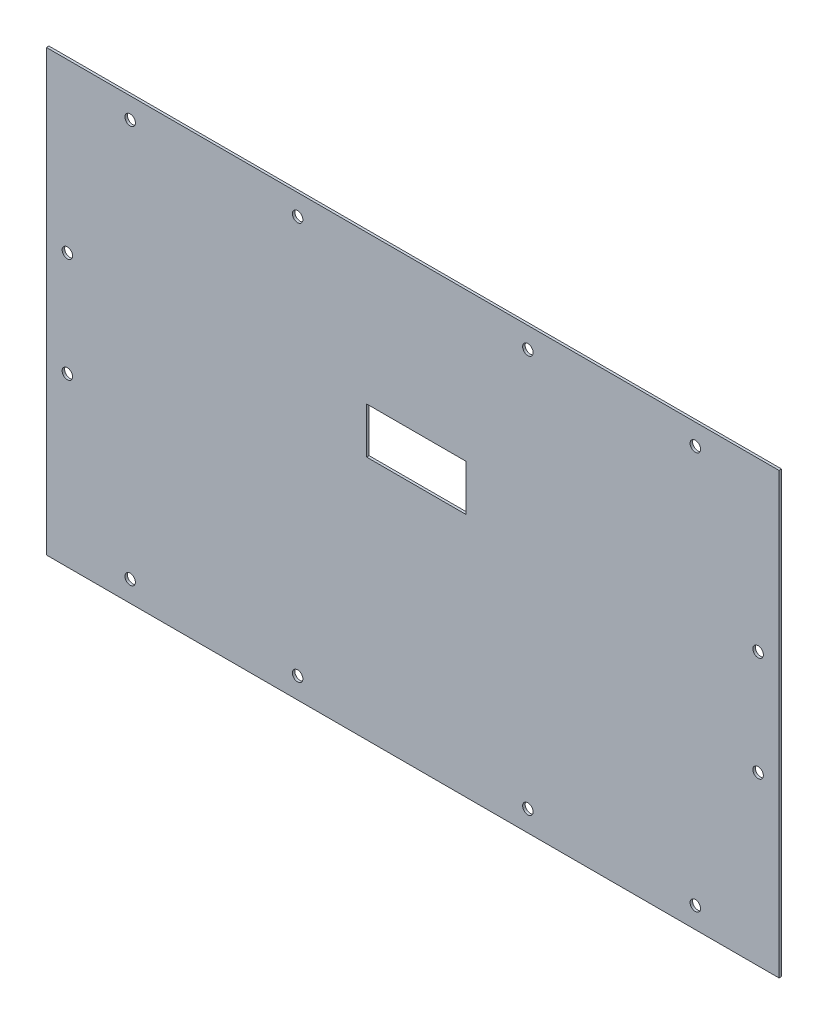
ISO-10303-21;
HEADER;
FILE_DESCRIPTION(('STEP AP214'),'2;1');
FILE_NAME('part.step','',(''),(''),'','','');
FILE_SCHEMA(('AUTOMOTIVE_DESIGN { 1 0 10303 214 1 1 1 1 }'));
ENDSEC;
DATA;
#1=APPLICATION_CONTEXT('core data for automotive mechanical design processes');
#2=APPLICATION_PROTOCOL_DEFINITION('international standard','automotive_design',2000,#1);
#3=PRODUCT_CONTEXT('',#1,'mechanical');
#4=PRODUCT('Part','Part','',(#3));
#5=PRODUCT_RELATED_PRODUCT_CATEGORY('part','',(#4));
#6=PRODUCT_DEFINITION_FORMATION('','',#4);
#7=PRODUCT_DEFINITION_CONTEXT('part definition',#1,'design');
#8=PRODUCT_DEFINITION('design','',#6,#7);
#9=PRODUCT_DEFINITION_SHAPE('','',#8);
#10=(LENGTH_UNIT() NAMED_UNIT(*) SI_UNIT(.MILLI.,.METRE.));
#11=(NAMED_UNIT(*) PLANE_ANGLE_UNIT() SI_UNIT($,.RADIAN.));
#12=(NAMED_UNIT(*) SI_UNIT($,.STERADIAN.) SOLID_ANGLE_UNIT());
#13=UNCERTAINTY_MEASURE_WITH_UNIT(LENGTH_MEASURE(1.E-05),#10,'distance_accuracy_value','');
#14=(GEOMETRIC_REPRESENTATION_CONTEXT(3) GLOBAL_UNCERTAINTY_ASSIGNED_CONTEXT((#13)) GLOBAL_UNIT_ASSIGNED_CONTEXT((#10,
#11,#12)) REPRESENTATION_CONTEXT('',''));
#15=CARTESIAN_POINT('',(0.,0.,0.));
#16=DIRECTION('',(0.,0.,1.));
#17=DIRECTION('',(1.,0.,0.));
#18=AXIS2_PLACEMENT_3D('',#15,#16,#17);
#19=CARTESIAN_POINT('',(0.,0.,0.));
#20=DIRECTION('',(-1.,0.,0.));
#21=DIRECTION('',(0.,1.,0.));
#22=AXIS2_PLACEMENT_3D('',#19,#20,#21);
#23=PLANE('',#22);
#24=DIRECTION('',(0.,0.,-1.));
#25=VECTOR('',#24,1.);
#26=CARTESIAN_POINT('',(0.,0.,0.));
#27=LINE('',#26,#25);
#28=CARTESIAN_POINT('',(0.,0.,1.2));
#29=VERTEX_POINT('',#28);
#30=CARTESIAN_POINT('',(0.,0.,0.));
#31=VERTEX_POINT('',#30);
#32=EDGE_CURVE('E11',#29,#31,#27,.T.);
#33=ORIENTED_EDGE('',*,*,#32,.F.);
#34=DIRECTION('',(0.,1.,0.));
#35=VECTOR('',#34,1.);
#36=CARTESIAN_POINT('',(0.,0.,1.2));
#37=LINE('',#36,#35);
#38=CARTESIAN_POINT('',(0.,210.,1.2));
#39=VERTEX_POINT('',#38);
#40=EDGE_CURVE('E156',#29,#39,#37,.T.);
#41=ORIENTED_EDGE('',*,*,#40,.T.);
#42=DIRECTION('',(0.,0.,-1.));
#43=VECTOR('',#42,1.);
#44=CARTESIAN_POINT('',(0.,210.,0.));
#45=LINE('',#44,#43);
#46=CARTESIAN_POINT('',(0.,210.,0.));
#47=VERTEX_POINT('',#46);
#48=EDGE_CURVE('E44',#39,#47,#45,.T.);
#49=ORIENTED_EDGE('',*,*,#48,.T.);
#50=DIRECTION('',(0.,1.,0.));
#51=VECTOR('',#50,1.);
#52=CARTESIAN_POINT('',(0.,0.,0.));
#53=LINE('',#52,#51);
#54=EDGE_CURVE('E137',#31,#47,#53,.T.);
#55=ORIENTED_EDGE('',*,*,#54,.F.);
#56=EDGE_LOOP('',(#33,#41,#49,#55));
#57=FACE_BOUND('',#56,.T.);
#58=ADVANCED_FACE('F35',(#57),#23,.T.);
#59=CARTESIAN_POINT('',(0.,210.,0.));
#60=DIRECTION('',(0.,1.,0.));
#61=DIRECTION('',(1.,0.,0.));
#62=AXIS2_PLACEMENT_3D('',#59,#60,#61);
#63=PLANE('',#62);
#64=ORIENTED_EDGE('',*,*,#48,.F.);
#65=DIRECTION('',(-1.,0.,0.));
#66=VECTOR('',#65,1.);
#67=CARTESIAN_POINT('',(0.,210.,1.2));
#68=LINE('',#67,#66);
#69=CARTESIAN_POINT('',(350.,210.,1.2));
#70=VERTEX_POINT('',#69);
#71=EDGE_CURVE('E145',#39,#70,#68,.F.);
#72=ORIENTED_EDGE('',*,*,#71,.T.);
#73=DIRECTION('',(0.,0.,-1.));
#74=VECTOR('',#73,1.);
#75=CARTESIAN_POINT('',(350.,210.,0.));
#76=LINE('',#75,#74);
#77=CARTESIAN_POINT('',(350.,210.,0.));
#78=VERTEX_POINT('',#77);
#79=EDGE_CURVE('E161',#70,#78,#76,.T.);
#80=ORIENTED_EDGE('',*,*,#79,.T.);
#81=DIRECTION('',(1.,0.,0.));
#82=VECTOR('',#81,1.);
#83=CARTESIAN_POINT('',(0.,210.,0.));
#84=LINE('',#83,#82);
#85=EDGE_CURVE('E140',#47,#78,#84,.T.);
#86=ORIENTED_EDGE('',*,*,#85,.F.);
#87=EDGE_LOOP('',(#64,#72,#80,#86));
#88=FACE_BOUND('',#87,.T.);
#89=ADVANCED_FACE('F268',(#88),#63,.T.);
#90=CARTESIAN_POINT('',(350.,0.,0.));
#91=DIRECTION('',(-1.,0.,0.));
#92=DIRECTION('',(0.,1.,0.));
#93=AXIS2_PLACEMENT_3D('',#90,#91,#92);
#94=PLANE('',#93);
#95=ORIENTED_EDGE('',*,*,#79,.F.);
#96=DIRECTION('',(0.,1.,0.));
#97=VECTOR('',#96,1.);
#98=CARTESIAN_POINT('',(350.,0.,1.2));
#99=LINE('',#98,#97);
#100=CARTESIAN_POINT('',(350.,0.,1.2));
#101=VERTEX_POINT('',#100);
#102=EDGE_CURVE('E136',#101,#70,#99,.T.);
#103=ORIENTED_EDGE('',*,*,#102,.F.);
#104=DIRECTION('',(0.,0.,-1.));
#105=VECTOR('',#104,1.);
#106=CARTESIAN_POINT('',(350.,0.,0.));
#107=LINE('',#106,#105);
#108=CARTESIAN_POINT('',(350.,0.,0.));
#109=VERTEX_POINT('',#108);
#110=EDGE_CURVE('E148',#101,#109,#107,.T.);
#111=ORIENTED_EDGE('',*,*,#110,.T.);
#112=DIRECTION('',(0.,1.,0.));
#113=VECTOR('',#112,1.);
#114=CARTESIAN_POINT('',(350.,0.,0.));
#115=LINE('',#114,#113);
#116=EDGE_CURVE('E142',#109,#78,#115,.T.);
#117=ORIENTED_EDGE('',*,*,#116,.T.);
#118=EDGE_LOOP('',(#95,#103,#111,#117));
#119=FACE_BOUND('',#118,.T.);
#120=ADVANCED_FACE('F269',(#119),#94,.F.);
#121=CARTESIAN_POINT('',(0.,0.,0.));
#122=DIRECTION('',(0.,1.,0.));
#123=DIRECTION('',(1.,0.,0.));
#124=AXIS2_PLACEMENT_3D('',#121,#122,#123);
#125=PLANE('',#124);
#126=DIRECTION('',(-1.,0.,0.));
#127=VECTOR('',#126,1.);
#128=CARTESIAN_POINT('',(0.,0.,1.2));
#129=LINE('',#128,#127);
#130=EDGE_CURVE('E153',#29,#101,#129,.F.);
#131=ORIENTED_EDGE('',*,*,#130,.F.);
#132=ORIENTED_EDGE('',*,*,#32,.T.);
#133=DIRECTION('',(1.,0.,0.));
#134=VECTOR('',#133,1.);
#135=CARTESIAN_POINT('',(0.,0.,0.));
#136=LINE('',#135,#134);
#137=EDGE_CURVE('E141',#31,#109,#136,.T.);
#138=ORIENTED_EDGE('',*,*,#137,.T.);
#139=ORIENTED_EDGE('',*,*,#110,.F.);
#140=EDGE_LOOP('',(#131,#132,#138,#139));
#141=FACE_BOUND('',#140,.T.);
#142=ADVANCED_FACE('F37',(#141),#125,.F.);
#143=CARTESIAN_POINT('',(0.,0.,0.));
#144=DIRECTION('',(0.,0.,-1.));
#145=DIRECTION('',(-1.,0.,0.));
#146=AXIS2_PLACEMENT_3D('',#143,#144,#145);
#147=PLANE('',#146);
#148=CARTESIAN_POINT('',(120.,10.,0.));
#149=DIRECTION('',(0.,0.,-1.));
#150=DIRECTION('',(-1.,0.,0.));
#151=AXIS2_PLACEMENT_3D('',#148,#149,#150);
#152=CIRCLE('',#151,2.5);
#153=CARTESIAN_POINT('',(117.5,10.,0.));
#154=VERTEX_POINT('',#153);
#155=EDGE_CURVE('E218',#154,#154,#152,.T.);
#156=ORIENTED_EDGE('',*,*,#155,.F.);
#157=EDGE_LOOP('',(#156));
#158=FACE_BOUND('',#157,.T.);
#159=CARTESIAN_POINT('',(40.,10.0000000000001,0.));
#160=DIRECTION('',(0.,0.,-1.));
#161=DIRECTION('',(-1.,0.,0.));
#162=AXIS2_PLACEMENT_3D('',#159,#160,#161);
#163=CIRCLE('',#162,2.50000000000002);
#164=CARTESIAN_POINT('',(37.5,10.0000000000001,0.));
#165=VERTEX_POINT('',#164);
#166=EDGE_CURVE('E221',#165,#165,#163,.T.);
#167=ORIENTED_EDGE('',*,*,#166,.F.);
#168=EDGE_LOOP('',(#167));
#169=FACE_BOUND('',#168,.T.);
#170=CARTESIAN_POINT('',(10.,80.,0.));
#171=DIRECTION('',(0.,0.,-1.));
#172=DIRECTION('',(-1.,0.,0.));
#173=AXIS2_PLACEMENT_3D('',#170,#171,#172);
#174=CIRCLE('',#173,2.50000000000002);
#175=CARTESIAN_POINT('',(7.49999999999999,80.,0.));
#176=VERTEX_POINT('',#175);
#177=EDGE_CURVE('E225',#176,#176,#174,.T.);
#178=ORIENTED_EDGE('',*,*,#177,.F.);
#179=EDGE_LOOP('',(#178));
#180=FACE_BOUND('',#179,.T.);
#181=CARTESIAN_POINT('',(40.,200.,0.));
#182=DIRECTION('',(0.,0.,-1.));
#183=DIRECTION('',(1.,0.,0.));
#184=AXIS2_PLACEMENT_3D('',#181,#182,#183);
#185=CIRCLE('',#184,2.50000000000002);
#186=CARTESIAN_POINT('',(42.5,200.,0.));
#187=VERTEX_POINT('',#186);
#188=EDGE_CURVE('E210',#187,#187,#185,.T.);
#189=ORIENTED_EDGE('',*,*,#188,.F.);
#190=EDGE_LOOP('',(#189));
#191=FACE_BOUND('',#190,.T.);
#192=CARTESIAN_POINT('',(120.,200.,0.));
#193=DIRECTION('',(0.,0.,-1.));
#194=DIRECTION('',(1.,0.,0.));
#195=AXIS2_PLACEMENT_3D('',#192,#193,#194);
#196=CIRCLE('',#195,2.5);
#197=CARTESIAN_POINT('',(122.5,200.,0.));
#198=VERTEX_POINT('',#197);
#199=EDGE_CURVE('E206',#198,#198,#196,.T.);
#200=ORIENTED_EDGE('',*,*,#199,.F.);
#201=EDGE_LOOP('',(#200));
#202=FACE_BOUND('',#201,.T.);
#203=CARTESIAN_POINT('',(10.,130.,0.));
#204=DIRECTION('',(0.,0.,-1.));
#205=DIRECTION('',(1.,0.,0.));
#206=AXIS2_PLACEMENT_3D('',#203,#204,#205);
#207=CIRCLE('',#206,2.50000000000002);
#208=CARTESIAN_POINT('',(12.5,130.,0.));
#209=VERTEX_POINT('',#208);
#210=EDGE_CURVE('E209',#209,#209,#207,.T.);
#211=ORIENTED_EDGE('',*,*,#210,.F.);
#212=EDGE_LOOP('',(#211));
#213=FACE_BOUND('',#212,.T.);
#214=CARTESIAN_POINT('',(340.,130.,0.));
#215=DIRECTION('',(0.,0.,-1.));
#216=DIRECTION('',(-1.,0.,0.));
#217=AXIS2_PLACEMENT_3D('',#214,#215,#216);
#218=CIRCLE('',#217,2.50000000000002);
#219=CARTESIAN_POINT('',(337.5,130.,0.));
#220=VERTEX_POINT('',#219);
#221=EDGE_CURVE('E213',#220,#220,#218,.T.);
#222=ORIENTED_EDGE('',*,*,#221,.F.);
#223=EDGE_LOOP('',(#222));
#224=FACE_BOUND('',#223,.T.);
#225=CARTESIAN_POINT('',(230.,200.,0.));
#226=DIRECTION('',(0.,0.,-1.));
#227=DIRECTION('',(-1.,0.,0.));
#228=AXIS2_PLACEMENT_3D('',#225,#226,#227);
#229=CIRCLE('',#228,2.5);
#230=CARTESIAN_POINT('',(227.5,200.,0.));
#231=VERTEX_POINT('',#230);
#232=EDGE_CURVE('E205',#231,#231,#229,.T.);
#233=ORIENTED_EDGE('',*,*,#232,.F.);
#234=EDGE_LOOP('',(#233));
#235=FACE_BOUND('',#234,.T.);
#236=CARTESIAN_POINT('',(230.,10.,0.));
#237=DIRECTION('',(0.,0.,-1.));
#238=DIRECTION('',(1.,0.,0.));
#239=AXIS2_PLACEMENT_3D('',#236,#237,#238);
#240=CIRCLE('',#239,2.5);
#241=CARTESIAN_POINT('',(232.5,10.,0.));
#242=VERTEX_POINT('',#241);
#243=EDGE_CURVE('E222',#242,#242,#240,.T.);
#244=ORIENTED_EDGE('',*,*,#243,.F.);
#245=EDGE_LOOP('',(#244));
#246=FACE_BOUND('',#245,.T.);
#247=CARTESIAN_POINT('',(310.,10.0000000000001,0.));
#248=DIRECTION('',(0.,0.,-1.));
#249=DIRECTION('',(1.,0.,0.));
#250=AXIS2_PLACEMENT_3D('',#247,#248,#249);
#251=CIRCLE('',#250,2.50000000000002);
#252=CARTESIAN_POINT('',(312.5,10.0000000000001,0.));
#253=VERTEX_POINT('',#252);
#254=EDGE_CURVE('E233',#253,#253,#251,.T.);
#255=ORIENTED_EDGE('',*,*,#254,.F.);
#256=EDGE_LOOP('',(#255));
#257=FACE_BOUND('',#256,.T.);
#258=CARTESIAN_POINT('',(340.,80.,0.));
#259=DIRECTION('',(0.,0.,-1.));
#260=DIRECTION('',(1.,0.,0.));
#261=AXIS2_PLACEMENT_3D('',#258,#259,#260);
#262=CIRCLE('',#261,2.50000000000002);
#263=CARTESIAN_POINT('',(342.5,80.,0.));
#264=VERTEX_POINT('',#263);
#265=EDGE_CURVE('E230',#264,#264,#262,.T.);
#266=ORIENTED_EDGE('',*,*,#265,.F.);
#267=EDGE_LOOP('',(#266));
#268=FACE_BOUND('',#267,.T.);
#269=CARTESIAN_POINT('',(310.,200.,0.));
#270=DIRECTION('',(0.,0.,-1.));
#271=DIRECTION('',(-1.,0.,0.));
#272=AXIS2_PLACEMENT_3D('',#269,#270,#271);
#273=CIRCLE('',#272,2.50000000000002);
#274=CARTESIAN_POINT('',(307.5,200.,0.));
#275=VERTEX_POINT('',#274);
#276=EDGE_CURVE('E169',#275,#275,#273,.T.);
#277=ORIENTED_EDGE('',*,*,#276,.F.);
#278=EDGE_LOOP('',(#277));
#279=FACE_BOUND('',#278,.T.);
#280=DIRECTION('',(0.,1.,0.));
#281=VECTOR('',#280,1.);
#282=CARTESIAN_POINT('',(153.,0.,0.));
#283=LINE('',#282,#281);
#284=CARTESIAN_POINT('',(153.,117.,0.));
#285=VERTEX_POINT('',#284);
#286=CARTESIAN_POINT('',(153.,139.,0.));
#287=VERTEX_POINT('',#286);
#288=EDGE_CURVE('E134',#285,#287,#283,.T.);
#289=ORIENTED_EDGE('',*,*,#288,.F.);
#290=DIRECTION('',(-1.,0.,0.));
#291=VECTOR('',#290,1.);
#292=CARTESIAN_POINT('',(0.,117.,0.));
#293=LINE('',#292,#291);
#294=CARTESIAN_POINT('',(200.5,117.,0.));
#295=VERTEX_POINT('',#294);
#296=EDGE_CURVE('E127',#295,#285,#293,.T.);
#297=ORIENTED_EDGE('',*,*,#296,.F.);
#298=DIRECTION('',(0.,-1.,0.));
#299=VECTOR('',#298,1.);
#300=CARTESIAN_POINT('',(200.5,0.,0.));
#301=LINE('',#300,#299);
#302=CARTESIAN_POINT('',(200.5,139.,0.));
#303=VERTEX_POINT('',#302);
#304=EDGE_CURVE('E107',#303,#295,#301,.T.);
#305=ORIENTED_EDGE('',*,*,#304,.F.);
#306=DIRECTION('',(1.,0.,0.));
#307=VECTOR('',#306,1.);
#308=CARTESIAN_POINT('',(0.,139.,0.));
#309=LINE('',#308,#307);
#310=EDGE_CURVE('E132',#287,#303,#309,.T.);
#311=ORIENTED_EDGE('',*,*,#310,.F.);
#312=EDGE_LOOP('',(#289,#297,#305,#311));
#313=FACE_BOUND('',#312,.T.);
#314=ORIENTED_EDGE('',*,*,#116,.F.);
#315=ORIENTED_EDGE('',*,*,#137,.F.);
#316=ORIENTED_EDGE('',*,*,#54,.T.);
#317=ORIENTED_EDGE('',*,*,#85,.T.);
#318=EDGE_LOOP('',(#314,#315,#316,#317));
#319=FACE_BOUND('',#318,.T.);
#320=ADVANCED_FACE('F242',(#158,#169,#180,#191,#202,#213,#224,#235,#246,#257,#268,#279,#313,
#319),#147,.T.);
#321=CARTESIAN_POINT('',(0.,0.,1.2));
#322=DIRECTION('',(0.,0.,-1.));
#323=DIRECTION('',(-1.,0.,0.));
#324=AXIS2_PLACEMENT_3D('',#321,#322,#323);
#325=PLANE('',#324);
#326=CARTESIAN_POINT('',(120.,10.,1.2));
#327=DIRECTION('',(0.,0.,-1.));
#328=DIRECTION('',(-1.,0.,0.));
#329=AXIS2_PLACEMENT_3D('',#326,#327,#328);
#330=CIRCLE('',#329,2.5);
#331=CARTESIAN_POINT('',(117.5,10.,1.2));
#332=VERTEX_POINT('',#331);
#333=EDGE_CURVE('E39',#332,#332,#330,.T.);
#334=ORIENTED_EDGE('',*,*,#333,.T.);
#335=EDGE_LOOP('',(#334));
#336=FACE_BOUND('',#335,.T.);
#337=CARTESIAN_POINT('',(40.,10.0000000000001,1.2));
#338=DIRECTION('',(0.,0.,-1.));
#339=DIRECTION('',(-1.,0.,0.));
#340=AXIS2_PLACEMENT_3D('',#337,#338,#339);
#341=CIRCLE('',#340,2.50000000000002);
#342=CARTESIAN_POINT('',(37.5,10.0000000000001,1.2));
#343=VERTEX_POINT('',#342);
#344=EDGE_CURVE('E195',#343,#343,#341,.T.);
#345=ORIENTED_EDGE('',*,*,#344,.T.);
#346=EDGE_LOOP('',(#345));
#347=FACE_BOUND('',#346,.T.);
#348=CARTESIAN_POINT('',(10.,80.,1.2));
#349=DIRECTION('',(0.,0.,-1.));
#350=DIRECTION('',(-1.,0.,0.));
#351=AXIS2_PLACEMENT_3D('',#348,#349,#350);
#352=CIRCLE('',#351,2.50000000000002);
#353=CARTESIAN_POINT('',(7.49999999999999,80.,1.2));
#354=VERTEX_POINT('',#353);
#355=EDGE_CURVE('E193',#354,#354,#352,.T.);
#356=ORIENTED_EDGE('',*,*,#355,.T.);
#357=EDGE_LOOP('',(#356));
#358=FACE_BOUND('',#357,.T.);
#359=CARTESIAN_POINT('',(40.,200.,1.2));
#360=DIRECTION('',(0.,0.,-1.));
#361=DIRECTION('',(-1.,0.,0.));
#362=AXIS2_PLACEMENT_3D('',#359,#360,#361);
#363=CIRCLE('',#362,2.50000000000002);
#364=CARTESIAN_POINT('',(37.5,200.,1.2));
#365=VERTEX_POINT('',#364);
#366=EDGE_CURVE('E190',#365,#365,#363,.T.);
#367=ORIENTED_EDGE('',*,*,#366,.T.);
#368=EDGE_LOOP('',(#367));
#369=FACE_BOUND('',#368,.T.);
#370=CARTESIAN_POINT('',(120.,200.,1.2));
#371=DIRECTION('',(0.,0.,-1.));
#372=DIRECTION('',(-1.,0.,0.));
#373=AXIS2_PLACEMENT_3D('',#370,#371,#372);
#374=CIRCLE('',#373,2.5);
#375=CARTESIAN_POINT('',(117.5,200.,1.2));
#376=VERTEX_POINT('',#375);
#377=EDGE_CURVE('E187',#376,#376,#374,.T.);
#378=ORIENTED_EDGE('',*,*,#377,.T.);
#379=EDGE_LOOP('',(#378));
#380=FACE_BOUND('',#379,.T.);
#381=CARTESIAN_POINT('',(10.,130.,1.2));
#382=DIRECTION('',(0.,0.,-1.));
#383=DIRECTION('',(-1.,0.,0.));
#384=AXIS2_PLACEMENT_3D('',#381,#382,#383);
#385=CIRCLE('',#384,2.50000000000002);
#386=CARTESIAN_POINT('',(7.49999999999999,130.,1.2));
#387=VERTEX_POINT('',#386);
#388=EDGE_CURVE('E184',#387,#387,#385,.T.);
#389=ORIENTED_EDGE('',*,*,#388,.T.);
#390=EDGE_LOOP('',(#389));
#391=FACE_BOUND('',#390,.T.);
#392=CARTESIAN_POINT('',(340.,130.,1.2));
#393=DIRECTION('',(0.,0.,-1.));
#394=DIRECTION('',(-1.,0.,0.));
#395=AXIS2_PLACEMENT_3D('',#392,#393,#394);
#396=CIRCLE('',#395,2.50000000000002);
#397=CARTESIAN_POINT('',(337.5,130.,1.2));
#398=VERTEX_POINT('',#397);
#399=EDGE_CURVE('E181',#398,#398,#396,.T.);
#400=ORIENTED_EDGE('',*,*,#399,.T.);
#401=EDGE_LOOP('',(#400));
#402=FACE_BOUND('',#401,.T.);
#403=CARTESIAN_POINT('',(230.,200.,1.2));
#404=DIRECTION('',(0.,0.,-1.));
#405=DIRECTION('',(-1.,0.,0.));
#406=AXIS2_PLACEMENT_3D('',#403,#404,#405);
#407=CIRCLE('',#406,2.5);
#408=CARTESIAN_POINT('',(227.5,200.,1.2));
#409=VERTEX_POINT('',#408);
#410=EDGE_CURVE('E178',#409,#409,#407,.T.);
#411=ORIENTED_EDGE('',*,*,#410,.T.);
#412=EDGE_LOOP('',(#411));
#413=FACE_BOUND('',#412,.T.);
#414=CARTESIAN_POINT('',(230.,10.,1.2));
#415=DIRECTION('',(0.,0.,-1.));
#416=DIRECTION('',(-1.,0.,0.));
#417=AXIS2_PLACEMENT_3D('',#414,#415,#416);
#418=CIRCLE('',#417,2.5);
#419=CARTESIAN_POINT('',(227.5,10.,1.2));
#420=VERTEX_POINT('',#419);
#421=EDGE_CURVE('E175',#420,#420,#418,.T.);
#422=ORIENTED_EDGE('',*,*,#421,.T.);
#423=EDGE_LOOP('',(#422));
#424=FACE_BOUND('',#423,.T.);
#425=CARTESIAN_POINT('',(310.,10.0000000000001,1.2));
#426=DIRECTION('',(0.,0.,-1.));
#427=DIRECTION('',(-1.,0.,0.));
#428=AXIS2_PLACEMENT_3D('',#425,#426,#427);
#429=CIRCLE('',#428,2.50000000000002);
#430=CARTESIAN_POINT('',(307.5,10.0000000000001,1.2));
#431=VERTEX_POINT('',#430);
#432=EDGE_CURVE('E172',#431,#431,#429,.T.);
#433=ORIENTED_EDGE('',*,*,#432,.T.);
#434=EDGE_LOOP('',(#433));
#435=FACE_BOUND('',#434,.T.);
#436=CARTESIAN_POINT('',(340.,80.,1.2));
#437=DIRECTION('',(0.,0.,-1.));
#438=DIRECTION('',(-1.,0.,0.));
#439=AXIS2_PLACEMENT_3D('',#436,#437,#438);
#440=CIRCLE('',#439,2.50000000000002);
#441=CARTESIAN_POINT('',(337.5,80.,1.2));
#442=VERTEX_POINT('',#441);
#443=EDGE_CURVE('E168',#442,#442,#440,.T.);
#444=ORIENTED_EDGE('',*,*,#443,.T.);
#445=EDGE_LOOP('',(#444));
#446=FACE_BOUND('',#445,.T.);
#447=CARTESIAN_POINT('',(310.,200.,1.2));
#448=DIRECTION('',(0.,0.,-1.));
#449=DIRECTION('',(-1.,0.,0.));
#450=AXIS2_PLACEMENT_3D('',#447,#448,#449);
#451=CIRCLE('',#450,2.50000000000002);
#452=CARTESIAN_POINT('',(307.5,200.,1.2));
#453=VERTEX_POINT('',#452);
#454=EDGE_CURVE('E165',#453,#453,#451,.T.);
#455=ORIENTED_EDGE('',*,*,#454,.T.);
#456=EDGE_LOOP('',(#455));
#457=FACE_BOUND('',#456,.T.);
#458=DIRECTION('',(1.,0.,0.));
#459=VECTOR('',#458,1.);
#460=CARTESIAN_POINT('',(153.,117.,1.2));
#461=LINE('',#460,#459);
#462=CARTESIAN_POINT('',(153.,117.,1.2));
#463=VERTEX_POINT('',#462);
#464=CARTESIAN_POINT('',(200.5,117.,1.2));
#465=VERTEX_POINT('',#464);
#466=EDGE_CURVE('E113',#463,#465,#461,.T.);
#467=ORIENTED_EDGE('',*,*,#466,.F.);
#468=DIRECTION('',(0.,-1.,0.));
#469=VECTOR('',#468,1.);
#470=CARTESIAN_POINT('',(153.,139.,1.2));
#471=LINE('',#470,#469);
#472=CARTESIAN_POINT('',(153.,139.,1.2));
#473=VERTEX_POINT('',#472);
#474=EDGE_CURVE('E60',#473,#463,#471,.T.);
#475=ORIENTED_EDGE('',*,*,#474,.F.);
#476=DIRECTION('',(-1.,0.,0.));
#477=VECTOR('',#476,1.);
#478=CARTESIAN_POINT('',(153.,139.,1.2));
#479=LINE('',#478,#477);
#480=CARTESIAN_POINT('',(200.5,139.,1.2));
#481=VERTEX_POINT('',#480);
#482=EDGE_CURVE('E120',#481,#473,#479,.T.);
#483=ORIENTED_EDGE('',*,*,#482,.F.);
#484=DIRECTION('',(0.,1.,0.));
#485=VECTOR('',#484,1.);
#486=CARTESIAN_POINT('',(200.5,139.,1.2));
#487=LINE('',#486,#485);
#488=EDGE_CURVE('E104',#465,#481,#487,.T.);
#489=ORIENTED_EDGE('',*,*,#488,.F.);
#490=EDGE_LOOP('',(#467,#475,#483,#489));
#491=FACE_BOUND('',#490,.T.);
#492=ORIENTED_EDGE('',*,*,#102,.T.);
#493=ORIENTED_EDGE('',*,*,#71,.F.);
#494=ORIENTED_EDGE('',*,*,#40,.F.);
#495=ORIENTED_EDGE('',*,*,#130,.T.);
#496=EDGE_LOOP('',(#492,#493,#494,#495));
#497=FACE_BOUND('',#496,.T.);
#498=ADVANCED_FACE('F117',(#336,#347,#358,#369,#380,#391,#402,#413,#424,#435,#446,#457,#491,
#497),#325,.F.);
#499=CARTESIAN_POINT('',(153.,139.,-8.8));
#500=DIRECTION('',(-1.,0.,0.));
#501=DIRECTION('',(0.,0.,1.));
#502=AXIS2_PLACEMENT_3D('',#499,#500,#501);
#503=PLANE('',#502);
#504=ORIENTED_EDGE('',*,*,#288,.T.);
#505=DIRECTION('',(0.,0.,1.));
#506=VECTOR('',#505,1.);
#507=CARTESIAN_POINT('',(153.,139.,-8.8));
#508=LINE('',#507,#506);
#509=EDGE_CURVE('E125',#287,#473,#508,.T.);
#510=ORIENTED_EDGE('',*,*,#509,.T.);
#511=ORIENTED_EDGE('',*,*,#474,.T.);
#512=DIRECTION('',(0.,0.,1.));
#513=VECTOR('',#512,1.);
#514=CARTESIAN_POINT('',(153.,117.,-8.8));
#515=LINE('',#514,#513);
#516=EDGE_CURVE('E110',#285,#463,#515,.T.);
#517=ORIENTED_EDGE('',*,*,#516,.F.);
#518=EDGE_LOOP('',(#504,#510,#511,#517));
#519=FACE_BOUND('',#518,.T.);
#520=ADVANCED_FACE('F301',(#519),#503,.F.);
#521=CARTESIAN_POINT('',(153.,139.,-8.8));
#522=DIRECTION('',(0.,1.,0.));
#523=DIRECTION('',(0.,0.,1.));
#524=AXIS2_PLACEMENT_3D('',#521,#522,#523);
#525=PLANE('',#524);
#526=ORIENTED_EDGE('',*,*,#310,.T.);
#527=DIRECTION('',(0.,0.,1.));
#528=VECTOR('',#527,1.);
#529=CARTESIAN_POINT('',(200.5,139.,-8.8));
#530=LINE('',#529,#528);
#531=EDGE_CURVE('E109',#303,#481,#530,.T.);
#532=ORIENTED_EDGE('',*,*,#531,.T.);
#533=ORIENTED_EDGE('',*,*,#482,.T.);
#534=ORIENTED_EDGE('',*,*,#509,.F.);
#535=EDGE_LOOP('',(#526,#532,#533,#534));
#536=FACE_BOUND('',#535,.T.);
#537=ADVANCED_FACE('F306',(#536),#525,.F.);
#538=CARTESIAN_POINT('',(200.5,139.,-8.8));
#539=DIRECTION('',(1.,0.,0.));
#540=DIRECTION('',(0.,0.,-1.));
#541=AXIS2_PLACEMENT_3D('',#538,#539,#540);
#542=PLANE('',#541);
#543=ORIENTED_EDGE('',*,*,#304,.T.);
#544=DIRECTION('',(0.,0.,1.));
#545=VECTOR('',#544,1.);
#546=CARTESIAN_POINT('',(200.5,117.,-8.8));
#547=LINE('',#546,#545);
#548=EDGE_CURVE('E52',#295,#465,#547,.T.);
#549=ORIENTED_EDGE('',*,*,#548,.T.);
#550=ORIENTED_EDGE('',*,*,#488,.T.);
#551=ORIENTED_EDGE('',*,*,#531,.F.);
#552=EDGE_LOOP('',(#543,#549,#550,#551));
#553=FACE_BOUND('',#552,.T.);
#554=ADVANCED_FACE('F101',(#553),#542,.F.);
#555=CARTESIAN_POINT('',(153.,117.,-8.8));
#556=DIRECTION('',(0.,-1.,0.));
#557=DIRECTION('',(0.,0.,-1.));
#558=AXIS2_PLACEMENT_3D('',#555,#556,#557);
#559=PLANE('',#558);
#560=ORIENTED_EDGE('',*,*,#296,.T.);
#561=ORIENTED_EDGE('',*,*,#516,.T.);
#562=ORIENTED_EDGE('',*,*,#466,.T.);
#563=ORIENTED_EDGE('',*,*,#548,.F.);
#564=EDGE_LOOP('',(#560,#561,#562,#563));
#565=FACE_BOUND('',#564,.T.);
#566=ADVANCED_FACE('F114',(#565),#559,.F.);
#567=CARTESIAN_POINT('',(310.,200.,10.));
#568=DIRECTION('',(0.,0.,-1.));
#569=DIRECTION('',(-1.,0.,0.));
#570=AXIS2_PLACEMENT_3D('',#567,#568,#569);
#571=CYLINDRICAL_SURFACE('',#570,2.50000000000002);
#572=ORIENTED_EDGE('',*,*,#276,.T.);
#573=EDGE_LOOP('',(#572));
#574=FACE_BOUND('',#573,.T.);
#575=ORIENTED_EDGE('',*,*,#454,.F.);
#576=EDGE_LOOP('',(#575));
#577=FACE_BOUND('',#576,.T.);
#578=ADVANCED_FACE('F334',(#574,#577),#571,.F.);
#579=CARTESIAN_POINT('',(340.,80.,10.));
#580=DIRECTION('',(0.,0.,-1.));
#581=DIRECTION('',(-1.,0.,0.));
#582=AXIS2_PLACEMENT_3D('',#579,#580,#581);
#583=CYLINDRICAL_SURFACE('',#582,2.50000000000002);
#584=ORIENTED_EDGE('',*,*,#265,.T.);
#585=EDGE_LOOP('',(#584));
#586=FACE_BOUND('',#585,.T.);
#587=ORIENTED_EDGE('',*,*,#443,.F.);
#588=EDGE_LOOP('',(#587));
#589=FACE_BOUND('',#588,.T.);
#590=ADVANCED_FACE('F353',(#586,#589),#583,.F.);
#591=CARTESIAN_POINT('',(310.,10.0000000000001,10.));
#592=DIRECTION('',(0.,0.,-1.));
#593=DIRECTION('',(-1.,0.,0.));
#594=AXIS2_PLACEMENT_3D('',#591,#592,#593);
#595=CYLINDRICAL_SURFACE('',#594,2.50000000000002);
#596=ORIENTED_EDGE('',*,*,#254,.T.);
#597=EDGE_LOOP('',(#596));
#598=FACE_BOUND('',#597,.T.);
#599=ORIENTED_EDGE('',*,*,#432,.F.);
#600=EDGE_LOOP('',(#599));
#601=FACE_BOUND('',#600,.T.);
#602=ADVANCED_FACE('F363',(#598,#601),#595,.F.);
#603=CARTESIAN_POINT('',(230.,10.,10.));
#604=DIRECTION('',(0.,0.,-1.));
#605=DIRECTION('',(-1.,0.,0.));
#606=AXIS2_PLACEMENT_3D('',#603,#604,#605);
#607=CYLINDRICAL_SURFACE('',#606,2.5);
#608=ORIENTED_EDGE('',*,*,#243,.T.);
#609=EDGE_LOOP('',(#608));
#610=FACE_BOUND('',#609,.T.);
#611=ORIENTED_EDGE('',*,*,#421,.F.);
#612=EDGE_LOOP('',(#611));
#613=FACE_BOUND('',#612,.T.);
#614=ADVANCED_FACE('F239',(#610,#613),#607,.F.);
#615=CARTESIAN_POINT('',(230.,200.,10.));
#616=DIRECTION('',(0.,0.,-1.));
#617=DIRECTION('',(-1.,0.,0.));
#618=AXIS2_PLACEMENT_3D('',#615,#616,#617);
#619=CYLINDRICAL_SURFACE('',#618,2.5);
#620=ORIENTED_EDGE('',*,*,#232,.T.);
#621=EDGE_LOOP('',(#620));
#622=FACE_BOUND('',#621,.T.);
#623=ORIENTED_EDGE('',*,*,#410,.F.);
#624=EDGE_LOOP('',(#623));
#625=FACE_BOUND('',#624,.T.);
#626=ADVANCED_FACE('F382',(#622,#625),#619,.F.);
#627=CARTESIAN_POINT('',(340.,130.,10.));
#628=DIRECTION('',(0.,0.,-1.));
#629=DIRECTION('',(-1.,0.,0.));
#630=AXIS2_PLACEMENT_3D('',#627,#628,#629);
#631=CYLINDRICAL_SURFACE('',#630,2.50000000000002);
#632=ORIENTED_EDGE('',*,*,#221,.T.);
#633=EDGE_LOOP('',(#632));
#634=FACE_BOUND('',#633,.T.);
#635=ORIENTED_EDGE('',*,*,#399,.F.);
#636=EDGE_LOOP('',(#635));
#637=FACE_BOUND('',#636,.T.);
#638=ADVANCED_FACE('F391',(#634,#637),#631,.F.);
#639=CARTESIAN_POINT('',(10.,130.,10.));
#640=DIRECTION('',(0.,0.,-1.));
#641=DIRECTION('',(-1.,0.,0.));
#642=AXIS2_PLACEMENT_3D('',#639,#640,#641);
#643=CYLINDRICAL_SURFACE('',#642,2.50000000000002);
#644=ORIENTED_EDGE('',*,*,#210,.T.);
#645=EDGE_LOOP('',(#644));
#646=FACE_BOUND('',#645,.T.);
#647=ORIENTED_EDGE('',*,*,#388,.F.);
#648=EDGE_LOOP('',(#647));
#649=FACE_BOUND('',#648,.T.);
#650=ADVANCED_FACE('F401',(#646,#649),#643,.F.);
#651=CARTESIAN_POINT('',(120.,200.,10.));
#652=DIRECTION('',(0.,0.,-1.));
#653=DIRECTION('',(-1.,0.,0.));
#654=AXIS2_PLACEMENT_3D('',#651,#652,#653);
#655=CYLINDRICAL_SURFACE('',#654,2.5);
#656=ORIENTED_EDGE('',*,*,#199,.T.);
#657=EDGE_LOOP('',(#656));
#658=FACE_BOUND('',#657,.T.);
#659=ORIENTED_EDGE('',*,*,#377,.F.);
#660=EDGE_LOOP('',(#659));
#661=FACE_BOUND('',#660,.T.);
#662=ADVANCED_FACE('F411',(#658,#661),#655,.F.);
#663=CARTESIAN_POINT('',(40.,200.,10.));
#664=DIRECTION('',(0.,0.,-1.));
#665=DIRECTION('',(-1.,0.,0.));
#666=AXIS2_PLACEMENT_3D('',#663,#664,#665);
#667=CYLINDRICAL_SURFACE('',#666,2.50000000000002);
#668=ORIENTED_EDGE('',*,*,#188,.T.);
#669=EDGE_LOOP('',(#668));
#670=FACE_BOUND('',#669,.T.);
#671=ORIENTED_EDGE('',*,*,#366,.F.);
#672=EDGE_LOOP('',(#671));
#673=FACE_BOUND('',#672,.T.);
#674=ADVANCED_FACE('F421',(#670,#673),#667,.F.);
#675=CARTESIAN_POINT('',(10.,80.,10.));
#676=DIRECTION('',(0.,0.,-1.));
#677=DIRECTION('',(-1.,0.,0.));
#678=AXIS2_PLACEMENT_3D('',#675,#676,#677);
#679=CYLINDRICAL_SURFACE('',#678,2.50000000000002);
#680=ORIENTED_EDGE('',*,*,#177,.T.);
#681=EDGE_LOOP('',(#680));
#682=FACE_BOUND('',#681,.T.);
#683=ORIENTED_EDGE('',*,*,#355,.F.);
#684=EDGE_LOOP('',(#683));
#685=FACE_BOUND('',#684,.T.);
#686=ADVANCED_FACE('F431',(#682,#685),#679,.F.);
#687=CARTESIAN_POINT('',(40.,10.0000000000001,10.));
#688=DIRECTION('',(0.,0.,-1.));
#689=DIRECTION('',(-1.,0.,0.));
#690=AXIS2_PLACEMENT_3D('',#687,#688,#689);
#691=CYLINDRICAL_SURFACE('',#690,2.50000000000002);
#692=ORIENTED_EDGE('',*,*,#166,.T.);
#693=EDGE_LOOP('',(#692));
#694=FACE_BOUND('',#693,.T.);
#695=ORIENTED_EDGE('',*,*,#344,.F.);
#696=EDGE_LOOP('',(#695));
#697=FACE_BOUND('',#696,.T.);
#698=ADVANCED_FACE('F441',(#694,#697),#691,.F.);
#699=CARTESIAN_POINT('',(120.,10.,10.));
#700=DIRECTION('',(0.,0.,-1.));
#701=DIRECTION('',(-1.,0.,0.));
#702=AXIS2_PLACEMENT_3D('',#699,#700,#701);
#703=CYLINDRICAL_SURFACE('',#702,2.5);
#704=ORIENTED_EDGE('',*,*,#155,.T.);
#705=EDGE_LOOP('',(#704));
#706=FACE_BOUND('',#705,.T.);
#707=ORIENTED_EDGE('',*,*,#333,.F.);
#708=EDGE_LOOP('',(#707));
#709=FACE_BOUND('',#708,.T.);
#710=ADVANCED_FACE('F451',(#706,#709),#703,.F.);
#711=CLOSED_SHELL('',(#58,#89,#120,#142,#320,#498,#520,#537,#554,#566,#578,#590,#602,#614,#626,
#638,#650,#662,#674,#686,#698,#710));
#712=MANIFOLD_SOLID_BREP('B2',#711);
#713=ADVANCED_BREP_SHAPE_REPRESENTATION('',(#18,#712),#14);
#714=SHAPE_DEFINITION_REPRESENTATION(#9,#713);
ENDSEC;
END-ISO-10303-21;
